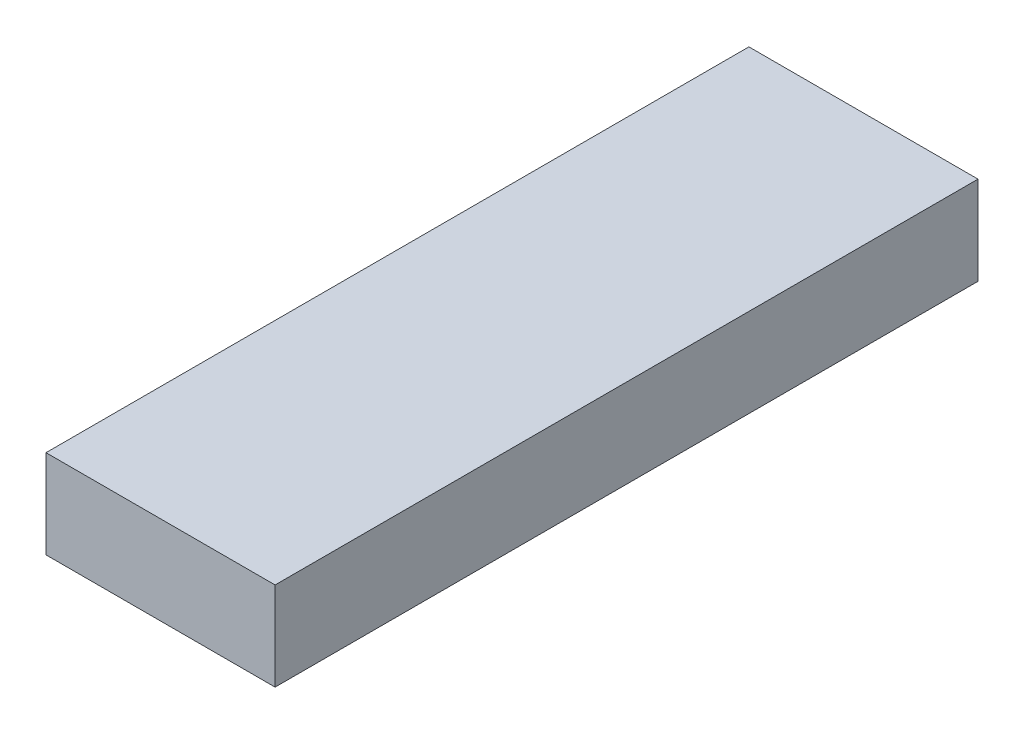
ISO-10303-21;
HEADER;
FILE_DESCRIPTION(('STEP AP214'),'2;1');
FILE_NAME('part.step','',(''),(''),'','','');
FILE_SCHEMA(('AUTOMOTIVE_DESIGN { 1 0 10303 214 1 1 1 1 }'));
ENDSEC;
DATA;
#1=APPLICATION_CONTEXT('core data for automotive mechanical design processes');
#2=APPLICATION_PROTOCOL_DEFINITION('international standard','automotive_design',2000,#1);
#3=PRODUCT_CONTEXT('',#1,'mechanical');
#4=PRODUCT('Part','Part','',(#3));
#5=PRODUCT_RELATED_PRODUCT_CATEGORY('part','',(#4));
#6=PRODUCT_DEFINITION_FORMATION('','',#4);
#7=PRODUCT_DEFINITION_CONTEXT('part definition',#1,'design');
#8=PRODUCT_DEFINITION('design','',#6,#7);
#9=PRODUCT_DEFINITION_SHAPE('','',#8);
#10=(LENGTH_UNIT() NAMED_UNIT(*) SI_UNIT(.MILLI.,.METRE.));
#11=(NAMED_UNIT(*) PLANE_ANGLE_UNIT() SI_UNIT($,.RADIAN.));
#12=(NAMED_UNIT(*) SI_UNIT($,.STERADIAN.) SOLID_ANGLE_UNIT());
#13=UNCERTAINTY_MEASURE_WITH_UNIT(LENGTH_MEASURE(1.E-05),#10,'distance_accuracy_value','');
#14=(GEOMETRIC_REPRESENTATION_CONTEXT(3) GLOBAL_UNCERTAINTY_ASSIGNED_CONTEXT((#13)) GLOBAL_UNIT_ASSIGNED_CONTEXT((#10,
#11,#12)) REPRESENTATION_CONTEXT('',''));
#15=CARTESIAN_POINT('',(0.,0.,0.));
#16=DIRECTION('',(0.,0.,1.));
#17=DIRECTION('',(1.,0.,0.));
#18=AXIS2_PLACEMENT_3D('',#15,#16,#17);
#19=CARTESIAN_POINT('',(0.,17.,0.));
#20=DIRECTION('',(1.,0.,0.));
#21=DIRECTION('',(0.,0.,-1.));
#22=AXIS2_PLACEMENT_3D('',#19,#20,#21);
#23=PLANE('',#22);
#24=DIRECTION('',(0.,0.,1.));
#25=VECTOR('',#24,1.);
#26=CARTESIAN_POINT('',(0.,0.,0.));
#27=LINE('',#26,#25);
#28=CARTESIAN_POINT('',(0.,0.,-135.));
#29=VERTEX_POINT('',#28);
#30=CARTESIAN_POINT('',(0.,0.,0.));
#31=VERTEX_POINT('',#30);
#32=EDGE_CURVE('E107',#29,#31,#27,.T.);
#33=ORIENTED_EDGE('',*,*,#32,.T.);
#34=DIRECTION('',(0.,-1.,0.));
#35=VECTOR('',#34,1.);
#36=CARTESIAN_POINT('',(0.,17.,0.));
#37=LINE('',#36,#35);
#38=CARTESIAN_POINT('',(0.,17.,0.));
#39=VERTEX_POINT('',#38);
#40=EDGE_CURVE('E11',#39,#31,#37,.T.);
#41=ORIENTED_EDGE('',*,*,#40,.F.);
#42=DIRECTION('',(0.,0.,1.));
#43=VECTOR('',#42,1.);
#44=CARTESIAN_POINT('',(0.,17.,0.));
#45=LINE('',#44,#43);
#46=CARTESIAN_POINT('',(0.,17.,-135.));
#47=VERTEX_POINT('',#46);
#48=EDGE_CURVE('E91',#47,#39,#45,.T.);
#49=ORIENTED_EDGE('',*,*,#48,.F.);
#50=DIRECTION('',(0.,-1.,0.));
#51=VECTOR('',#50,1.);
#52=CARTESIAN_POINT('',(0.,17.,-135.));
#53=LINE('',#52,#51);
#54=EDGE_CURVE('E103',#47,#29,#53,.T.);
#55=ORIENTED_EDGE('',*,*,#54,.T.);
#56=EDGE_LOOP('',(#33,#41,#49,#55));
#57=FACE_BOUND('',#56,.T.);
#58=ADVANCED_FACE('F39',(#57),#23,.F.);
#59=CARTESIAN_POINT('',(0.,17.,0.));
#60=DIRECTION('',(0.,0.,-1.));
#61=DIRECTION('',(-1.,0.,0.));
#62=AXIS2_PLACEMENT_3D('',#59,#60,#61);
#63=PLANE('',#62);
#64=DIRECTION('',(1.,0.,0.));
#65=VECTOR('',#64,1.);
#66=CARTESIAN_POINT('',(0.,0.,0.));
#67=LINE('',#66,#65);
#68=CARTESIAN_POINT('',(44.,0.,0.));
#69=VERTEX_POINT('',#68);
#70=EDGE_CURVE('E96',#31,#69,#67,.T.);
#71=ORIENTED_EDGE('',*,*,#70,.T.);
#72=DIRECTION('',(0.,-1.,0.));
#73=VECTOR('',#72,1.);
#74=CARTESIAN_POINT('',(44.,17.,0.));
#75=LINE('',#74,#73);
#76=CARTESIAN_POINT('',(44.,17.,0.));
#77=VERTEX_POINT('',#76);
#78=EDGE_CURVE('E48',#77,#69,#75,.T.);
#79=ORIENTED_EDGE('',*,*,#78,.F.);
#80=DIRECTION('',(1.,0.,0.));
#81=VECTOR('',#80,1.);
#82=CARTESIAN_POINT('',(0.,17.,0.));
#83=LINE('',#82,#81);
#84=EDGE_CURVE('E86',#39,#77,#83,.T.);
#85=ORIENTED_EDGE('',*,*,#84,.F.);
#86=ORIENTED_EDGE('',*,*,#40,.T.);
#87=EDGE_LOOP('',(#71,#79,#85,#86));
#88=FACE_BOUND('',#87,.T.);
#89=ADVANCED_FACE('F95',(#88),#63,.F.);
#90=CARTESIAN_POINT('',(44.,17.,0.));
#91=DIRECTION('',(-1.,0.,0.));
#92=DIRECTION('',(0.,0.,1.));
#93=AXIS2_PLACEMENT_3D('',#90,#91,#92);
#94=PLANE('',#93);
#95=DIRECTION('',(0.,0.,-1.));
#96=VECTOR('',#95,1.);
#97=CARTESIAN_POINT('',(44.,0.,0.));
#98=LINE('',#97,#96);
#99=CARTESIAN_POINT('',(44.,0.,-135.));
#100=VERTEX_POINT('',#99);
#101=EDGE_CURVE('E73',#69,#100,#98,.T.);
#102=ORIENTED_EDGE('',*,*,#101,.T.);
#103=DIRECTION('',(0.,-1.,0.));
#104=VECTOR('',#103,1.);
#105=CARTESIAN_POINT('',(44.,17.,-135.));
#106=LINE('',#105,#104);
#107=CARTESIAN_POINT('',(44.,17.,-135.));
#108=VERTEX_POINT('',#107);
#109=EDGE_CURVE('E98',#108,#100,#106,.T.);
#110=ORIENTED_EDGE('',*,*,#109,.F.);
#111=DIRECTION('',(0.,0.,-1.));
#112=VECTOR('',#111,1.);
#113=CARTESIAN_POINT('',(44.,17.,0.));
#114=LINE('',#113,#112);
#115=EDGE_CURVE('E89',#77,#108,#114,.T.);
#116=ORIENTED_EDGE('',*,*,#115,.F.);
#117=ORIENTED_EDGE('',*,*,#78,.T.);
#118=EDGE_LOOP('',(#102,#110,#116,#117));
#119=FACE_BOUND('',#118,.T.);
#120=ADVANCED_FACE('F99',(#119),#94,.F.);
#121=CARTESIAN_POINT('',(0.,17.,-135.));
#122=DIRECTION('',(0.,0.,1.));
#123=DIRECTION('',(1.,0.,0.));
#124=AXIS2_PLACEMENT_3D('',#121,#122,#123);
#125=PLANE('',#124);
#126=DIRECTION('',(-1.,0.,0.));
#127=VECTOR('',#126,1.);
#128=CARTESIAN_POINT('',(0.,0.,-135.));
#129=LINE('',#128,#127);
#130=EDGE_CURVE('E79',#100,#29,#129,.T.);
#131=ORIENTED_EDGE('',*,*,#130,.T.);
#132=ORIENTED_EDGE('',*,*,#54,.F.);
#133=DIRECTION('',(-1.,0.,0.));
#134=VECTOR('',#133,1.);
#135=CARTESIAN_POINT('',(0.,17.,-135.));
#136=LINE('',#135,#134);
#137=EDGE_CURVE('E56',#108,#47,#136,.T.);
#138=ORIENTED_EDGE('',*,*,#137,.F.);
#139=ORIENTED_EDGE('',*,*,#109,.T.);
#140=EDGE_LOOP('',(#131,#132,#138,#139));
#141=FACE_BOUND('',#140,.T.);
#142=ADVANCED_FACE('F120',(#141),#125,.F.);
#143=CARTESIAN_POINT('',(0.,17.,0.));
#144=DIRECTION('',(0.,-1.,0.));
#145=DIRECTION('',(0.,0.,-1.));
#146=AXIS2_PLACEMENT_3D('',#143,#144,#145);
#147=PLANE('',#146);
#148=ORIENTED_EDGE('',*,*,#48,.T.);
#149=ORIENTED_EDGE('',*,*,#84,.T.);
#150=ORIENTED_EDGE('',*,*,#115,.T.);
#151=ORIENTED_EDGE('',*,*,#137,.T.);
#152=EDGE_LOOP('',(#148,#149,#150,#151));
#153=FACE_BOUND('',#152,.T.);
#154=ADVANCED_FACE('F87',(#153),#147,.F.);
#155=CARTESIAN_POINT('',(0.,0.,0.));
#156=DIRECTION('',(0.,-1.,0.));
#157=DIRECTION('',(0.,0.,-1.));
#158=AXIS2_PLACEMENT_3D('',#155,#156,#157);
#159=PLANE('',#158);
#160=ORIENTED_EDGE('',*,*,#32,.F.);
#161=ORIENTED_EDGE('',*,*,#130,.F.);
#162=ORIENTED_EDGE('',*,*,#101,.F.);
#163=ORIENTED_EDGE('',*,*,#70,.F.);
#164=EDGE_LOOP('',(#160,#161,#162,#163));
#165=FACE_BOUND('',#164,.T.);
#166=ADVANCED_FACE('F123',(#165),#159,.T.);
#167=CLOSED_SHELL('',(#58,#89,#120,#142,#154,#166));
#168=MANIFOLD_SOLID_BREP('B2',#167);
#169=ADVANCED_BREP_SHAPE_REPRESENTATION('',(#18,#168),#14);
#170=SHAPE_DEFINITION_REPRESENTATION(#9,#169);
ENDSEC;
END-ISO-10303-21;
